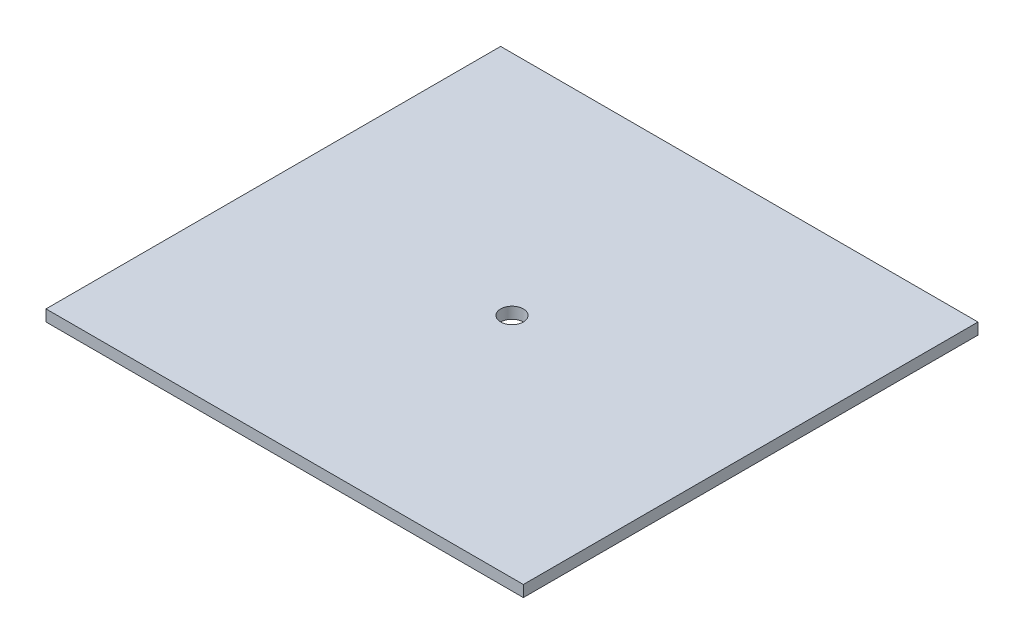
ISO-10303-21;
HEADER;
FILE_DESCRIPTION(('STEP AP214'),'2;1');
FILE_NAME('part.step','',(''),(''),'','','');
FILE_SCHEMA(('AUTOMOTIVE_DESIGN { 1 0 10303 214 1 1 1 1 }'));
ENDSEC;
DATA;
#1=APPLICATION_CONTEXT('core data for automotive mechanical design processes');
#2=APPLICATION_PROTOCOL_DEFINITION('international standard','automotive_design',2000,#1);
#3=PRODUCT_CONTEXT('',#1,'mechanical');
#4=PRODUCT('Part','Part','',(#3));
#5=PRODUCT_RELATED_PRODUCT_CATEGORY('part','',(#4));
#6=PRODUCT_DEFINITION_FORMATION('','',#4);
#7=PRODUCT_DEFINITION_CONTEXT('part definition',#1,'design');
#8=PRODUCT_DEFINITION('design','',#6,#7);
#9=PRODUCT_DEFINITION_SHAPE('','',#8);
#10=(LENGTH_UNIT() NAMED_UNIT(*) SI_UNIT(.MILLI.,.METRE.));
#11=(NAMED_UNIT(*) PLANE_ANGLE_UNIT() SI_UNIT($,.RADIAN.));
#12=(NAMED_UNIT(*) SI_UNIT($,.STERADIAN.) SOLID_ANGLE_UNIT());
#13=UNCERTAINTY_MEASURE_WITH_UNIT(LENGTH_MEASURE(1.E-05),#10,'distance_accuracy_value','');
#14=(GEOMETRIC_REPRESENTATION_CONTEXT(3) GLOBAL_UNCERTAINTY_ASSIGNED_CONTEXT((#13)) GLOBAL_UNIT_ASSIGNED_CONTEXT((#10,
#11,#12)) REPRESENTATION_CONTEXT('',''));
#15=CARTESIAN_POINT('',(0.,0.,0.));
#16=DIRECTION('',(0.,0.,1.));
#17=DIRECTION('',(1.,0.,0.));
#18=AXIS2_PLACEMENT_3D('',#15,#16,#17);
#19=CARTESIAN_POINT('',(-66.675,3.175,63.5));
#20=DIRECTION('',(1.,0.,0.));
#21=DIRECTION('',(0.,0.,-1.));
#22=AXIS2_PLACEMENT_3D('',#19,#20,#21);
#23=PLANE('',#22);
#24=DIRECTION('',(0.,0.,1.));
#25=VECTOR('',#24,1.);
#26=CARTESIAN_POINT('',(-66.675,0.,63.5));
#27=LINE('',#26,#25);
#28=CARTESIAN_POINT('',(-66.675,0.,-63.5));
#29=VERTEX_POINT('',#28);
#30=CARTESIAN_POINT('',(-66.675,0.,63.5));
#31=VERTEX_POINT('',#30);
#32=EDGE_CURVE('E107',#29,#31,#27,.T.);
#33=ORIENTED_EDGE('',*,*,#32,.T.);
#34=DIRECTION('',(0.,-1.,0.));
#35=VECTOR('',#34,1.);
#36=CARTESIAN_POINT('',(-66.675,3.175,63.5));
#37=LINE('',#36,#35);
#38=CARTESIAN_POINT('',(-66.675,3.175,63.5));
#39=VERTEX_POINT('',#38);
#40=EDGE_CURVE('E11',#39,#31,#37,.T.);
#41=ORIENTED_EDGE('',*,*,#40,.F.);
#42=DIRECTION('',(0.,0.,1.));
#43=VECTOR('',#42,1.);
#44=CARTESIAN_POINT('',(-66.675,3.175,63.5));
#45=LINE('',#44,#43);
#46=CARTESIAN_POINT('',(-66.675,3.175,-63.5));
#47=VERTEX_POINT('',#46);
#48=EDGE_CURVE('E91',#47,#39,#45,.T.);
#49=ORIENTED_EDGE('',*,*,#48,.F.);
#50=DIRECTION('',(0.,-1.,0.));
#51=VECTOR('',#50,1.);
#52=CARTESIAN_POINT('',(-66.675,3.175,-63.5));
#53=LINE('',#52,#51);
#54=EDGE_CURVE('E103',#47,#29,#53,.T.);
#55=ORIENTED_EDGE('',*,*,#54,.T.);
#56=EDGE_LOOP('',(#33,#41,#49,#55));
#57=FACE_BOUND('',#56,.T.);
#58=ADVANCED_FACE('F39',(#57),#23,.F.);
#59=CARTESIAN_POINT('',(66.675,3.175,63.5));
#60=DIRECTION('',(0.,0.,-1.));
#61=DIRECTION('',(-1.,0.,0.));
#62=AXIS2_PLACEMENT_3D('',#59,#60,#61);
#63=PLANE('',#62);
#64=DIRECTION('',(1.,0.,0.));
#65=VECTOR('',#64,1.);
#66=CARTESIAN_POINT('',(66.675,0.,63.5));
#67=LINE('',#66,#65);
#68=CARTESIAN_POINT('',(66.675,0.,63.5));
#69=VERTEX_POINT('',#68);
#70=EDGE_CURVE('E96',#31,#69,#67,.T.);
#71=ORIENTED_EDGE('',*,*,#70,.T.);
#72=DIRECTION('',(0.,-1.,0.));
#73=VECTOR('',#72,1.);
#74=CARTESIAN_POINT('',(66.675,3.175,63.5));
#75=LINE('',#74,#73);
#76=CARTESIAN_POINT('',(66.675,3.175,63.5));
#77=VERTEX_POINT('',#76);
#78=EDGE_CURVE('E48',#77,#69,#75,.T.);
#79=ORIENTED_EDGE('',*,*,#78,.F.);
#80=DIRECTION('',(1.,0.,0.));
#81=VECTOR('',#80,1.);
#82=CARTESIAN_POINT('',(66.675,3.175,63.5));
#83=LINE('',#82,#81);
#84=EDGE_CURVE('E86',#39,#77,#83,.T.);
#85=ORIENTED_EDGE('',*,*,#84,.F.);
#86=ORIENTED_EDGE('',*,*,#40,.T.);
#87=EDGE_LOOP('',(#71,#79,#85,#86));
#88=FACE_BOUND('',#87,.T.);
#89=ADVANCED_FACE('F95',(#88),#63,.F.);
#90=CARTESIAN_POINT('',(66.675,3.175,63.5));
#91=DIRECTION('',(-1.,0.,0.));
#92=DIRECTION('',(0.,0.,1.));
#93=AXIS2_PLACEMENT_3D('',#90,#91,#92);
#94=PLANE('',#93);
#95=DIRECTION('',(0.,0.,-1.));
#96=VECTOR('',#95,1.);
#97=CARTESIAN_POINT('',(66.675,0.,63.5));
#98=LINE('',#97,#96);
#99=CARTESIAN_POINT('',(66.675,0.,-63.5));
#100=VERTEX_POINT('',#99);
#101=EDGE_CURVE('E73',#69,#100,#98,.T.);
#102=ORIENTED_EDGE('',*,*,#101,.T.);
#103=DIRECTION('',(0.,-1.,0.));
#104=VECTOR('',#103,1.);
#105=CARTESIAN_POINT('',(66.675,3.175,-63.5));
#106=LINE('',#105,#104);
#107=CARTESIAN_POINT('',(66.675,3.175,-63.5));
#108=VERTEX_POINT('',#107);
#109=EDGE_CURVE('E98',#108,#100,#106,.T.);
#110=ORIENTED_EDGE('',*,*,#109,.F.);
#111=DIRECTION('',(0.,0.,-1.));
#112=VECTOR('',#111,1.);
#113=CARTESIAN_POINT('',(66.675,3.175,63.5));
#114=LINE('',#113,#112);
#115=EDGE_CURVE('E89',#77,#108,#114,.T.);
#116=ORIENTED_EDGE('',*,*,#115,.F.);
#117=ORIENTED_EDGE('',*,*,#78,.T.);
#118=EDGE_LOOP('',(#102,#110,#116,#117));
#119=FACE_BOUND('',#118,.T.);
#120=ADVANCED_FACE('F99',(#119),#94,.F.);
#121=CARTESIAN_POINT('',(66.675,3.175,-63.5));
#122=DIRECTION('',(0.,0.,1.));
#123=DIRECTION('',(1.,0.,0.));
#124=AXIS2_PLACEMENT_3D('',#121,#122,#123);
#125=PLANE('',#124);
#126=DIRECTION('',(-1.,0.,0.));
#127=VECTOR('',#126,1.);
#128=CARTESIAN_POINT('',(66.675,0.,-63.5));
#129=LINE('',#128,#127);
#130=EDGE_CURVE('E79',#100,#29,#129,.T.);
#131=ORIENTED_EDGE('',*,*,#130,.T.);
#132=ORIENTED_EDGE('',*,*,#54,.F.);
#133=DIRECTION('',(-1.,0.,0.));
#134=VECTOR('',#133,1.);
#135=CARTESIAN_POINT('',(66.675,3.175,-63.5));
#136=LINE('',#135,#134);
#137=EDGE_CURVE('E56',#108,#47,#136,.T.);
#138=ORIENTED_EDGE('',*,*,#137,.F.);
#139=ORIENTED_EDGE('',*,*,#109,.T.);
#140=EDGE_LOOP('',(#131,#132,#138,#139));
#141=FACE_BOUND('',#140,.T.);
#142=ADVANCED_FACE('F121',(#141),#125,.F.);
#143=CARTESIAN_POINT('',(0.,3.175,0.));
#144=DIRECTION('',(0.,1.,0.));
#145=DIRECTION('',(0.,0.,1.));
#146=AXIS2_PLACEMENT_3D('',#143,#144,#145);
#147=PLANE('',#146);
#148=CARTESIAN_POINT('',(0.,3.175,0.));
#149=DIRECTION('',(0.,1.,0.));
#150=DIRECTION('',(0.,0.,1.));
#151=AXIS2_PLACEMENT_3D('',#148,#149,#150);
#152=CIRCLE('',#151,3.175);
#153=CARTESIAN_POINT('',(0.,3.175,3.175));
#154=VERTEX_POINT('',#153);
#155=EDGE_CURVE('E128',#154,#154,#152,.T.);
#156=ORIENTED_EDGE('',*,*,#155,.F.);
#157=EDGE_LOOP('',(#156));
#158=FACE_BOUND('',#157,.T.);
#159=ORIENTED_EDGE('',*,*,#48,.T.);
#160=ORIENTED_EDGE('',*,*,#84,.T.);
#161=ORIENTED_EDGE('',*,*,#115,.T.);
#162=ORIENTED_EDGE('',*,*,#137,.T.);
#163=EDGE_LOOP('',(#159,#160,#161,#162));
#164=FACE_BOUND('',#163,.T.);
#165=ADVANCED_FACE('F87',(#158,#164),#147,.T.);
#166=CARTESIAN_POINT('',(0.,0.,0.));
#167=DIRECTION('',(0.,1.,0.));
#168=DIRECTION('',(0.,0.,1.));
#169=AXIS2_PLACEMENT_3D('',#166,#167,#168);
#170=PLANE('',#169);
#171=CARTESIAN_POINT('',(0.,0.,0.));
#172=DIRECTION('',(0.,1.,0.));
#173=DIRECTION('',(0.,0.,1.));
#174=AXIS2_PLACEMENT_3D('',#171,#172,#173);
#175=CIRCLE('',#174,3.175);
#176=CARTESIAN_POINT('',(0.,0.,3.175));
#177=VERTEX_POINT('',#176);
#178=EDGE_CURVE('E111',#177,#177,#175,.T.);
#179=ORIENTED_EDGE('',*,*,#178,.T.);
#180=EDGE_LOOP('',(#179));
#181=FACE_BOUND('',#180,.T.);
#182=ORIENTED_EDGE('',*,*,#32,.F.);
#183=ORIENTED_EDGE('',*,*,#130,.F.);
#184=ORIENTED_EDGE('',*,*,#101,.F.);
#185=ORIENTED_EDGE('',*,*,#70,.F.);
#186=EDGE_LOOP('',(#182,#183,#184,#185));
#187=FACE_BOUND('',#186,.T.);
#188=ADVANCED_FACE('F124',(#181,#187),#170,.F.);
#189=CARTESIAN_POINT('',(0.,0.,0.));
#190=DIRECTION('',(0.,1.,0.));
#191=DIRECTION('',(0.,0.,1.));
#192=AXIS2_PLACEMENT_3D('',#189,#190,#191);
#193=CYLINDRICAL_SURFACE('',#192,3.175);
#194=ORIENTED_EDGE('',*,*,#178,.F.);
#195=EDGE_LOOP('',(#194));
#196=FACE_BOUND('',#195,.T.);
#197=ORIENTED_EDGE('',*,*,#155,.T.);
#198=EDGE_LOOP('',(#197));
#199=FACE_BOUND('',#198,.T.);
#200=ADVANCED_FACE('F137',(#196,#199),#193,.F.);
#201=CLOSED_SHELL('',(#58,#89,#120,#142,#165,#188,#200));
#202=MANIFOLD_SOLID_BREP('B2',#201);
#203=ADVANCED_BREP_SHAPE_REPRESENTATION('',(#18,#202),#14);
#204=SHAPE_DEFINITION_REPRESENTATION(#9,#203);
ENDSEC;
END-ISO-10303-21;
